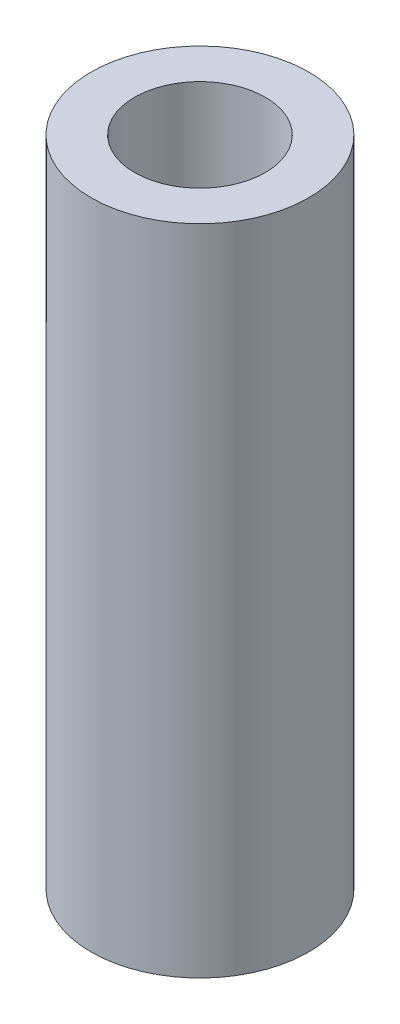
ISO-10303-21;
HEADER;
FILE_DESCRIPTION(('STEP AP214'),'2;1');
FILE_NAME('part.step','',(''),(''),'','','');
FILE_SCHEMA(('AUTOMOTIVE_DESIGN { 1 0 10303 214 1 1 1 1 }'));
ENDSEC;
DATA;
#1=APPLICATION_CONTEXT('core data for automotive mechanical design processes');
#2=APPLICATION_PROTOCOL_DEFINITION('international standard','automotive_design',2000,#1);
#3=PRODUCT_CONTEXT('',#1,'mechanical');
#4=PRODUCT('Part','Part','',(#3));
#5=PRODUCT_RELATED_PRODUCT_CATEGORY('part','',(#4));
#6=PRODUCT_DEFINITION_FORMATION('','',#4);
#7=PRODUCT_DEFINITION_CONTEXT('part definition',#1,'design');
#8=PRODUCT_DEFINITION('design','',#6,#7);
#9=PRODUCT_DEFINITION_SHAPE('','',#8);
#10=(LENGTH_UNIT() NAMED_UNIT(*) SI_UNIT(.MILLI.,.METRE.));
#11=(NAMED_UNIT(*) PLANE_ANGLE_UNIT() SI_UNIT($,.RADIAN.));
#12=(NAMED_UNIT(*) SI_UNIT($,.STERADIAN.) SOLID_ANGLE_UNIT());
#13=UNCERTAINTY_MEASURE_WITH_UNIT(LENGTH_MEASURE(1.E-05),#10,'distance_accuracy_value','');
#14=(GEOMETRIC_REPRESENTATION_CONTEXT(3) GLOBAL_UNCERTAINTY_ASSIGNED_CONTEXT((#13)) GLOBAL_UNIT_ASSIGNED_CONTEXT((#10,
#11,#12)) REPRESENTATION_CONTEXT('',''));
#15=CARTESIAN_POINT('',(0.,0.,0.));
#16=DIRECTION('',(0.,0.,1.));
#17=DIRECTION('',(1.,0.,0.));
#18=AXIS2_PLACEMENT_3D('',#15,#16,#17);
#19=CARTESIAN_POINT('',(0.,15.,0.));
#20=DIRECTION('',(0.,1.,0.));
#21=DIRECTION('',(0.,0.,1.));
#22=AXIS2_PLACEMENT_3D('',#19,#20,#21);
#23=PLANE('',#22);
#24=CARTESIAN_POINT('',(0.,15.,0.));
#25=DIRECTION('',(0.,1.,0.));
#26=DIRECTION('',(0.,0.,1.));
#27=AXIS2_PLACEMENT_3D('',#24,#25,#26);
#28=CIRCLE('',#27,2.5);
#29=CARTESIAN_POINT('',(0.,15.,2.5));
#30=VERTEX_POINT('',#29);
#31=EDGE_CURVE('E10',#30,#30,#28,.T.);
#32=ORIENTED_EDGE('',*,*,#31,.T.);
#33=EDGE_LOOP('',(#32));
#34=FACE_BOUND('',#33,.T.);
#35=CARTESIAN_POINT('',(0.,15.,0.));
#36=DIRECTION('',(0.,1.,0.));
#37=DIRECTION('',(0.,0.,1.));
#38=AXIS2_PLACEMENT_3D('',#35,#36,#37);
#39=CIRCLE('',#38,1.5);
#40=CARTESIAN_POINT('',(0.,15.,1.5));
#41=VERTEX_POINT('',#40);
#42=EDGE_CURVE('E52',#41,#41,#39,.T.);
#43=ORIENTED_EDGE('',*,*,#42,.F.);
#44=EDGE_LOOP('',(#43));
#45=FACE_BOUND('',#44,.T.);
#46=ADVANCED_FACE('F39',(#34,#45),#23,.T.);
#47=CARTESIAN_POINT('',(0.,0.,0.));
#48=DIRECTION('',(0.,1.,0.));
#49=DIRECTION('',(0.,0.,1.));
#50=AXIS2_PLACEMENT_3D('',#47,#48,#49);
#51=PLANE('',#50);
#52=CARTESIAN_POINT('',(0.,0.,0.));
#53=DIRECTION('',(0.,1.,0.));
#54=DIRECTION('',(0.,0.,1.));
#55=AXIS2_PLACEMENT_3D('',#52,#53,#54);
#56=CIRCLE('',#55,2.5);
#57=CARTESIAN_POINT('',(0.,0.,2.5));
#58=VERTEX_POINT('',#57);
#59=EDGE_CURVE('E43',#58,#58,#56,.T.);
#60=ORIENTED_EDGE('',*,*,#59,.F.);
#61=EDGE_LOOP('',(#60));
#62=FACE_BOUND('',#61,.T.);
#63=CARTESIAN_POINT('',(0.,0.,0.));
#64=DIRECTION('',(0.,1.,0.));
#65=DIRECTION('',(0.,0.,1.));
#66=AXIS2_PLACEMENT_3D('',#63,#64,#65);
#67=CIRCLE('',#66,1.5);
#68=CARTESIAN_POINT('',(0.,0.,1.5));
#69=VERTEX_POINT('',#68);
#70=EDGE_CURVE('E54',#69,#69,#67,.T.);
#71=ORIENTED_EDGE('',*,*,#70,.T.);
#72=EDGE_LOOP('',(#71));
#73=FACE_BOUND('',#72,.T.);
#74=ADVANCED_FACE('F66',(#62,#73),#51,.F.);
#75=CARTESIAN_POINT('',(0.,15.,0.));
#76=DIRECTION('',(0.,-1.,0.));
#77=DIRECTION('',(0.,0.,-1.));
#78=AXIS2_PLACEMENT_3D('',#75,#76,#77);
#79=CYLINDRICAL_SURFACE('',#78,2.5);
#80=ORIENTED_EDGE('',*,*,#31,.F.);
#81=EDGE_LOOP('',(#80));
#82=FACE_BOUND('',#81,.T.);
#83=ORIENTED_EDGE('',*,*,#59,.T.);
#84=EDGE_LOOP('',(#83));
#85=FACE_BOUND('',#84,.T.);
#86=ADVANCED_FACE('F41',(#82,#85),#79,.T.);
#87=CARTESIAN_POINT('',(0.,15.,0.));
#88=DIRECTION('',(0.,-1.,0.));
#89=DIRECTION('',(0.,0.,-1.));
#90=AXIS2_PLACEMENT_3D('',#87,#88,#89);
#91=CYLINDRICAL_SURFACE('',#90,1.5);
#92=ORIENTED_EDGE('',*,*,#42,.T.);
#93=EDGE_LOOP('',(#92));
#94=FACE_BOUND('',#93,.T.);
#95=ORIENTED_EDGE('',*,*,#70,.F.);
#96=EDGE_LOOP('',(#95));
#97=FACE_BOUND('',#96,.T.);
#98=ADVANCED_FACE('F62',(#94,#97),#91,.F.);
#99=CLOSED_SHELL('',(#46,#74,#86,#98));
#100=MANIFOLD_SOLID_BREP('B2',#99);
#101=ADVANCED_BREP_SHAPE_REPRESENTATION('',(#18,#100),#14);
#102=SHAPE_DEFINITION_REPRESENTATION(#9,#101);
ENDSEC;
END-ISO-10303-21;
